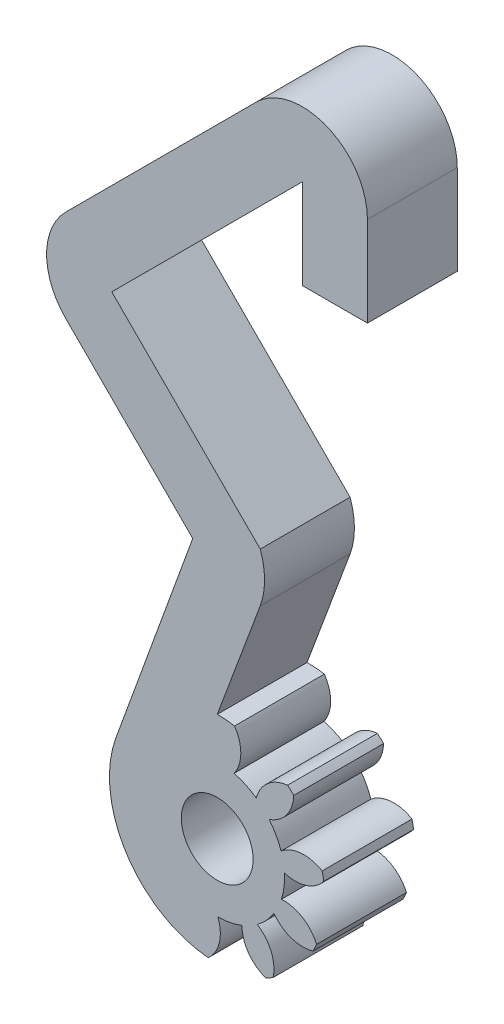
ISO-10303-21;
HEADER;
FILE_DESCRIPTION(('STEP AP214'),'2;1');
FILE_NAME('part.step','',(''),(''),'','','');
FILE_SCHEMA(('AUTOMOTIVE_DESIGN { 1 0 10303 214 1 1 1 1 }'));
ENDSEC;
DATA;
#1=APPLICATION_CONTEXT('core data for automotive mechanical design processes');
#2=APPLICATION_PROTOCOL_DEFINITION('international standard','automotive_design',2000,#1);
#3=PRODUCT_CONTEXT('',#1,'mechanical');
#4=PRODUCT('Part','Part','',(#3));
#5=PRODUCT_RELATED_PRODUCT_CATEGORY('part','',(#4));
#6=PRODUCT_DEFINITION_FORMATION('','',#4);
#7=PRODUCT_DEFINITION_CONTEXT('part definition',#1,'design');
#8=PRODUCT_DEFINITION('design','',#6,#7);
#9=PRODUCT_DEFINITION_SHAPE('','',#8);
#10=(LENGTH_UNIT() NAMED_UNIT(*) SI_UNIT(.MILLI.,.METRE.));
#11=(NAMED_UNIT(*) PLANE_ANGLE_UNIT() SI_UNIT($,.RADIAN.));
#12=(NAMED_UNIT(*) SI_UNIT($,.STERADIAN.) SOLID_ANGLE_UNIT());
#13=UNCERTAINTY_MEASURE_WITH_UNIT(LENGTH_MEASURE(1.E-05),#10,'distance_accuracy_value','');
#14=(GEOMETRIC_REPRESENTATION_CONTEXT(3) GLOBAL_UNCERTAINTY_ASSIGNED_CONTEXT((#13)) GLOBAL_UNIT_ASSIGNED_CONTEXT((#10,
#11,#12)) REPRESENTATION_CONTEXT('',''));
#15=CARTESIAN_POINT('',(0.,0.,0.));
#16=DIRECTION('',(0.,0.,1.));
#17=DIRECTION('',(1.,0.,0.));
#18=AXIS2_PLACEMENT_3D('',#15,#16,#17);
#19=CARTESIAN_POINT('',(-2.52011471353378,6.26983190867547,5.));
#20=DIRECTION('',(0.,0.,-1.));
#21=DIRECTION('',(-1.,0.,0.));
#22=AXIS2_PLACEMENT_3D('',#19,#20,#21);
#23=CYLINDRICAL_SURFACE('',#22,3.749);
#24=DIRECTION('',(0.,0.,-1.));
#25=VECTOR('',#24,1.);
#26=CARTESIAN_POINT('',(1.03442302820571,7.46157955081689,5.));
#27=LINE('',#26,#25);
#28=CARTESIAN_POINT('',(1.0344230282057,7.46157955081689,5.));
#29=VERTEX_POINT('',#28);
#30=CARTESIAN_POINT('',(1.03442302820571,7.46157955081689,0.));
#31=VERTEX_POINT('',#30);
#32=EDGE_CURVE('E263',#29,#31,#27,.T.);
#33=ORIENTED_EDGE('',*,*,#32,.T.);
#34=CARTESIAN_POINT('',(-2.52011471353378,6.26983190867547,0.));
#35=DIRECTION('',(0.,0.,1.));
#36=DIRECTION('',(-1.,0.,0.));
#37=AXIS2_PLACEMENT_3D('',#34,#35,#36);
#38=CIRCLE('',#37,3.749);
#39=CARTESIAN_POINT('',(0.374162630274847,8.65272083959863,0.));
#40=VERTEX_POINT('',#39);
#41=EDGE_CURVE('E290',#31,#40,#38,.T.);
#42=ORIENTED_EDGE('',*,*,#41,.T.);
#43=DIRECTION('',(0.,0.,-1.));
#44=VECTOR('',#43,1.);
#45=CARTESIAN_POINT('',(0.374162630274851,8.65272083959864,5.));
#46=LINE('',#45,#44);
#47=CARTESIAN_POINT('',(0.374162630274847,8.65272083959863,5.));
#48=VERTEX_POINT('',#47);
#49=EDGE_CURVE('E293',#48,#40,#46,.T.);
#50=ORIENTED_EDGE('',*,*,#49,.F.);
#51=CARTESIAN_POINT('',(-2.52011471353378,6.26983190867547,5.));
#52=DIRECTION('',(0.,0.,1.));
#53=DIRECTION('',(-1.,0.,0.));
#54=AXIS2_PLACEMENT_3D('',#51,#52,#53);
#55=CIRCLE('',#54,3.749);
#56=EDGE_CURVE('E298',#29,#48,#55,.T.);
#57=ORIENTED_EDGE('',*,*,#56,.F.);
#58=EDGE_LOOP('',(#33,#42,#50,#57));
#59=FACE_BOUND('',#58,.T.);
#60=ADVANCED_FACE('F39',(#59),#23,.T.);
#61=DIRECTION('',(0.,0.,-1.));
#62=VECTOR('',#61,1.);
#63=CARTESIAN_POINT('',(-0.344924961824448,9.32328086748562,5.));
#64=LINE('',#63,#62);
#65=CARTESIAN_POINT('',(-0.34492496182445,9.32328086748561,5.));
#66=VERTEX_POINT('',#65);
#67=CARTESIAN_POINT('',(-0.344924961824448,9.32328086748562,0.));
#68=VERTEX_POINT('',#67);
#69=EDGE_CURVE('E483',#66,#68,#64,.T.);
#70=ORIENTED_EDGE('',*,*,#69,.T.);
#71=CARTESIAN_POINT('',(-1.57922212740583,9.8988430882352,0.));
#72=VERTEX_POINT('',#71);
#73=EDGE_CURVE('E286',#68,#72,#38,.T.);
#74=ORIENTED_EDGE('',*,*,#73,.T.);
#75=DIRECTION('',(0.,0.,-1.));
#76=VECTOR('',#75,1.);
#77=CARTESIAN_POINT('',(-1.57922212740583,9.89884308823521,5.));
#78=LINE('',#77,#76);
#79=CARTESIAN_POINT('',(-1.57922212740583,9.8988430882352,5.));
#80=VERTEX_POINT('',#79);
#81=EDGE_CURVE('E55',#80,#72,#78,.T.);
#82=ORIENTED_EDGE('',*,*,#81,.F.);
#83=EDGE_CURVE('E59',#66,#80,#55,.T.);
#84=ORIENTED_EDGE('',*,*,#83,.F.);
#85=EDGE_LOOP('',(#70,#74,#82,#84));
#86=FACE_BOUND('',#85,.T.);
#87=ADVANCED_FACE('F721',(#86),#23,.T.);
#88=DIRECTION('',(0.,0.,-1.));
#89=VECTOR('',#88,1.);
#90=CARTESIAN_POINT('',(-2.48510792204046,2.52099535254911,5.));
#91=LINE('',#90,#89);
#92=CARTESIAN_POINT('',(-2.48510792204046,2.52099535254911,5.));
#93=VERTEX_POINT('',#92);
#94=CARTESIAN_POINT('',(-2.48510792204046,2.52099535254911,0.));
#95=VERTEX_POINT('',#94);
#96=EDGE_CURVE('E479',#93,#95,#91,.T.);
#97=ORIENTED_EDGE('',*,*,#96,.T.);
#98=CARTESIAN_POINT('',(-1.14823355384298,2.78085740551763,0.));
#99=VERTEX_POINT('',#98);
#100=EDGE_CURVE('E292',#95,#99,#38,.T.);
#101=ORIENTED_EDGE('',*,*,#100,.T.);
#102=DIRECTION('',(0.,0.,-1.));
#103=VECTOR('',#102,1.);
#104=CARTESIAN_POINT('',(-1.14823355384298,2.78085740551763,5.));
#105=LINE('',#104,#103);
#106=CARTESIAN_POINT('',(-1.14823355384298,2.78085740551764,5.));
#107=VERTEX_POINT('',#106);
#108=EDGE_CURVE('E485',#107,#99,#105,.T.);
#109=ORIENTED_EDGE('',*,*,#108,.F.);
#110=EDGE_CURVE('E299',#93,#107,#55,.T.);
#111=ORIENTED_EDGE('',*,*,#110,.F.);
#112=EDGE_LOOP('',(#97,#101,#109,#111));
#113=FACE_BOUND('',#112,.T.);
#114=ADVANCED_FACE('F674',(#113),#23,.T.);
#115=DIRECTION('',(0.,0.,-1.));
#116=VECTOR('',#115,1.);
#117=CARTESIAN_POINT('',(-0.288282783351155,3.25753590140504,5.));
#118=LINE('',#117,#116);
#119=CARTESIAN_POINT('',(-0.288282783351156,3.25753590140504,5.));
#120=VERTEX_POINT('',#119);
#121=CARTESIAN_POINT('',(-0.288282783351155,3.25753590140504,0.));
#122=VERTEX_POINT('',#121);
#123=EDGE_CURVE('E570',#120,#122,#118,.T.);
#124=ORIENTED_EDGE('',*,*,#123,.T.);
#125=CARTESIAN_POINT('',(0.640528217499533,4.25356375624405,0.));
#126=VERTEX_POINT('',#125);
#127=EDGE_CURVE('E669',#122,#126,#38,.T.);
#128=ORIENTED_EDGE('',*,*,#127,.T.);
#129=DIRECTION('',(0.,0.,-1.));
#130=VECTOR('',#129,1.);
#131=CARTESIAN_POINT('',(0.640528217499532,4.25356375624405,5.));
#132=LINE('',#131,#130);
#133=CARTESIAN_POINT('',(0.640528217499533,4.25356375624405,5.));
#134=VERTEX_POINT('',#133);
#135=EDGE_CURVE('E566',#134,#126,#132,.T.);
#136=ORIENTED_EDGE('',*,*,#135,.F.);
#137=EDGE_CURVE('E654',#120,#134,#55,.T.);
#138=ORIENTED_EDGE('',*,*,#137,.F.);
#139=EDGE_LOOP('',(#124,#128,#136,#138));
#140=FACE_BOUND('',#139,.T.);
#141=ADVANCED_FACE('F730',(#140),#23,.T.);
#142=DIRECTION('',(0.,0.,-1.));
#143=VECTOR('',#142,1.);
#144=CARTESIAN_POINT('',(1.05605841518567,5.14467114086269,5.));
#145=LINE('',#144,#143);
#146=CARTESIAN_POINT('',(1.05605841518566,5.14467114086269,5.));
#147=VERTEX_POINT('',#146);
#148=CARTESIAN_POINT('',(1.05605841518567,5.14467114086269,0.));
#149=VERTEX_POINT('',#148);
#150=EDGE_CURVE('E554',#147,#149,#145,.T.);
#151=ORIENTED_EDGE('',*,*,#150,.T.);
#152=CARTESIAN_POINT('',(1.2220318154894,6.49641601076531,0.));
#153=VERTEX_POINT('',#152);
#154=EDGE_CURVE('E662',#149,#153,#38,.T.);
#155=ORIENTED_EDGE('',*,*,#154,.T.);
#156=DIRECTION('',(0.,0.,-1.));
#157=VECTOR('',#156,1.);
#158=CARTESIAN_POINT('',(1.2220318154894,6.49641601076531,5.));
#159=LINE('',#158,#157);
#160=CARTESIAN_POINT('',(1.2220318154894,6.49641601076531,5.));
#161=VERTEX_POINT('',#160);
#162=EDGE_CURVE('E550',#161,#153,#159,.T.);
#163=ORIENTED_EDGE('',*,*,#162,.F.);
#164=EDGE_CURVE('E656',#147,#161,#55,.T.);
#165=ORIENTED_EDGE('',*,*,#164,.F.);
#166=EDGE_LOOP('',(#151,#155,#163,#165));
#167=FACE_BOUND('',#166,.T.);
#168=ADVANCED_FACE('F666',(#167),#23,.T.);
#169=CARTESIAN_POINT('',(-2.52011471353377,6.26983190867546,5.));
#170=DIRECTION('',(0.,0.,-1.));
#171=DIRECTION('',(-1.,0.,0.));
#172=AXIS2_PLACEMENT_3D('',#169,#170,#171);
#173=CYLINDRICAL_SURFACE('',#172,6.);
#174=CARTESIAN_POINT('',(-2.52011471353377,6.26983190867546,5.));
#175=DIRECTION('',(0.,0.,1.));
#176=DIRECTION('',(1.,0.,0.));
#177=AXIS2_PLACEMENT_3D('',#174,#175,#176);
#178=CIRCLE('',#177,6.);
#179=CARTESIAN_POINT('',(-1.55644099664738,12.1919373592211,5.));
#180=VERTEX_POINT('',#179);
#181=CARTESIAN_POINT('',(-2.52011471353377,12.2698319086755,5.));
#182=VERTEX_POINT('',#181);
#183=EDGE_CURVE('E347',#180,#182,#178,.T.);
#184=ORIENTED_EDGE('',*,*,#183,.F.);
#185=DIRECTION('',(0.,0.,-1.));
#186=VECTOR('',#185,1.);
#187=CARTESIAN_POINT('',(-1.55644099664738,12.1919373592211,5.));
#188=LINE('',#187,#186);
#189=CARTESIAN_POINT('',(-1.55644099664738,12.1919373592211,0.));
#190=VERTEX_POINT('',#189);
#191=EDGE_CURVE('E472',#180,#190,#188,.T.);
#192=ORIENTED_EDGE('',*,*,#191,.T.);
#193=CARTESIAN_POINT('',(-2.52011471353377,6.26983190867546,0.));
#194=DIRECTION('',(0.,0.,1.));
#195=DIRECTION('',(1.,0.,0.));
#196=AXIS2_PLACEMENT_3D('',#193,#194,#195);
#197=CIRCLE('',#196,6.);
#198=CARTESIAN_POINT('',(-2.52011471353377,12.2698319086755,0.));
#199=VERTEX_POINT('',#198);
#200=EDGE_CURVE('E394',#190,#199,#197,.T.);
#201=ORIENTED_EDGE('',*,*,#200,.T.);
#202=DIRECTION('',(0.,0.,-1.));
#203=VECTOR('',#202,1.);
#204=CARTESIAN_POINT('',(-2.52011471353377,12.2698319086755,5.));
#205=LINE('',#204,#203);
#206=EDGE_CURVE('E351',#182,#199,#205,.T.);
#207=ORIENTED_EDGE('',*,*,#206,.F.);
#208=EDGE_LOOP('',(#184,#192,#201,#207));
#209=FACE_BOUND('',#208,.T.);
#210=ADVANCED_FACE('F477',(#209),#173,.T.);
#211=CARTESIAN_POINT('',(-2.52011471353377,12.2698319086755,5.));
#212=DIRECTION('',(-0.937067689095554,0.349147742443107,0.));
#213=DIRECTION('',(-0.349147742443107,-0.937067689095554,0.));
#214=AXIS2_PLACEMENT_3D('',#211,#212,#213);
#215=PLANE('',#214);
#216=DIRECTION('',(0.349147742443107,0.937067689095554,0.));
#217=VECTOR('',#216,1.);
#218=CARTESIAN_POINT('',(-2.52011471353377,12.2698319086755,0.));
#219=LINE('',#218,#217);
#220=CARTESIAN_POINT('',(-0.124248163534779,18.7000299551507,0.));
#221=VERTEX_POINT('',#220);
#222=EDGE_CURVE('E305',#199,#221,#219,.T.);
#223=ORIENTED_EDGE('',*,*,#222,.T.);
#224=DIRECTION('',(0.,0.,-1.));
#225=VECTOR('',#224,1.);
#226=CARTESIAN_POINT('',(-0.124248163534779,18.7000299551507,5.));
#227=LINE('',#226,#225);
#228=CARTESIAN_POINT('',(-0.124248163534779,18.7000299551507,5.));
#229=VERTEX_POINT('',#228);
#230=EDGE_CURVE('E11',#229,#221,#227,.T.);
#231=ORIENTED_EDGE('',*,*,#230,.F.);
#232=DIRECTION('',(0.349147742443107,0.937067689095554,0.));
#233=VECTOR('',#232,1.);
#234=CARTESIAN_POINT('',(-2.52011471353377,12.2698319086755,5.));
#235=LINE('',#234,#233);
#236=EDGE_CURVE('E306',#182,#229,#235,.T.);
#237=ORIENTED_EDGE('',*,*,#236,.F.);
#238=ORIENTED_EDGE('',*,*,#206,.T.);
#239=EDGE_LOOP('',(#223,#231,#237,#238));
#240=FACE_BOUND('',#239,.T.);
#241=ADVANCED_FACE('F41',(#240),#215,.F.);
#242=CARTESIAN_POINT('',(-3.88301864667842,20.0681105284533,5.));
#243=DIRECTION('',(0.,0.,-1.));
#244=DIRECTION('',(-1.,0.,0.));
#245=AXIS2_PLACEMENT_3D('',#242,#243,#244);
#246=CYLINDRICAL_SURFACE('',#245,4.);
#247=CARTESIAN_POINT('',(-3.88301864667842,20.0681105284533,0.));
#248=DIRECTION('',(0.,0.,1.));
#249=DIRECTION('',(1.,0.,0.));
#250=AXIS2_PLACEMENT_3D('',#247,#248,#249);
#251=CIRCLE('',#250,4.);
#252=CARTESIAN_POINT('',(-0.124248163534785,21.436191101756,0.));
#253=VERTEX_POINT('',#252);
#254=EDGE_CURVE('E355',#221,#253,#251,.T.);
#255=ORIENTED_EDGE('',*,*,#254,.T.);
#256=DIRECTION('',(0.,0.,-1.));
#257=VECTOR('',#256,1.);
#258=CARTESIAN_POINT('',(-0.124248163534785,21.436191101756,5.));
#259=LINE('',#258,#257);
#260=CARTESIAN_POINT('',(-0.124248163534785,21.436191101756,5.));
#261=VERTEX_POINT('',#260);
#262=EDGE_CURVE('E48',#261,#253,#259,.T.);
#263=ORIENTED_EDGE('',*,*,#262,.F.);
#264=CARTESIAN_POINT('',(-3.88301864667842,20.0681105284533,5.));
#265=DIRECTION('',(0.,0.,1.));
#266=DIRECTION('',(1.,0.,0.));
#267=AXIS2_PLACEMENT_3D('',#264,#265,#266);
#268=CIRCLE('',#267,4.);
#269=EDGE_CURVE('E310',#229,#261,#268,.T.);
#270=ORIENTED_EDGE('',*,*,#269,.F.);
#271=ORIENTED_EDGE('',*,*,#230,.T.);
#272=EDGE_LOOP('',(#255,#263,#270,#271));
#273=FACE_BOUND('',#272,.T.);
#274=ADVANCED_FACE('F441',(#273),#246,.T.);
#275=CARTESIAN_POINT('',(-8.3906609303208,29.7026038685419,5.));
#276=DIRECTION('',(0.707106781186544,0.707106781186552,0.));
#277=DIRECTION('',(-0.707106781186552,0.707106781186544,0.));
#278=AXIS2_PLACEMENT_3D('',#275,#276,#277);
#279=PLANE('',#278);
#280=DIRECTION('',(0.707106781186552,-0.707106781186544,0.));
#281=VECTOR('',#280,1.);
#282=CARTESIAN_POINT('',(-8.3906609303208,29.7026038685419,0.));
#283=LINE('',#282,#281);
#284=CARTESIAN_POINT('',(-8.3906609303208,29.7026038685419,0.));
#285=VERTEX_POINT('',#284);
#286=EDGE_CURVE('E359',#285,#253,#283,.T.);
#287=ORIENTED_EDGE('',*,*,#286,.F.);
#288=DIRECTION('',(0.,0.,-1.));
#289=VECTOR('',#288,1.);
#290=CARTESIAN_POINT('',(-8.3906609303208,29.7026038685419,5.));
#291=LINE('',#290,#289);
#292=CARTESIAN_POINT('',(-8.3906609303208,29.7026038685419,5.));
#293=VERTEX_POINT('',#292);
#294=EDGE_CURVE('E432',#293,#285,#291,.T.);
#295=ORIENTED_EDGE('',*,*,#294,.F.);
#296=DIRECTION('',(0.707106781186552,-0.707106781186544,0.));
#297=VECTOR('',#296,1.);
#298=CARTESIAN_POINT('',(-8.3906609303208,29.7026038685419,5.));
#299=LINE('',#298,#297);
#300=EDGE_CURVE('E314',#293,#261,#299,.T.);
#301=ORIENTED_EDGE('',*,*,#300,.T.);
#302=ORIENTED_EDGE('',*,*,#262,.T.);
#303=EDGE_LOOP('',(#287,#295,#301,#302));
#304=FACE_BOUND('',#303,.T.);
#305=ADVANCED_FACE('F438',(#304),#279,.T.);
#306=CARTESIAN_POINT('',(-8.3906609303208,29.7026038685419,5.));
#307=DIRECTION('',(-0.707106781186548,0.707106781186548,0.));
#308=DIRECTION('',(-0.707106781186548,-0.707106781186548,0.));
#309=AXIS2_PLACEMENT_3D('',#306,#307,#308);
#310=PLANE('',#309);
#311=DIRECTION('',(0.707106781186548,0.707106781186548,0.));
#312=VECTOR('',#311,1.);
#313=CARTESIAN_POINT('',(-8.3906609303208,29.7026038685419,0.));
#314=LINE('',#313,#312);
#315=CARTESIAN_POINT('',(2.21594078747746,40.3092055863402,0.));
#316=VERTEX_POINT('',#315);
#317=EDGE_CURVE('E363',#285,#316,#314,.T.);
#318=ORIENTED_EDGE('',*,*,#317,.T.);
#319=DIRECTION('',(0.,0.,-1.));
#320=VECTOR('',#319,1.);
#321=CARTESIAN_POINT('',(2.21594078747746,40.3092055863402,5.));
#322=LINE('',#321,#320);
#323=CARTESIAN_POINT('',(2.21594078747746,40.3092055863402,5.));
#324=VERTEX_POINT('',#323);
#325=EDGE_CURVE('E428',#324,#316,#322,.T.);
#326=ORIENTED_EDGE('',*,*,#325,.F.);
#327=DIRECTION('',(0.707106781186548,0.707106781186548,0.));
#328=VECTOR('',#327,1.);
#329=CARTESIAN_POINT('',(-8.3906609303208,29.7026038685419,5.));
#330=LINE('',#329,#328);
#331=EDGE_CURVE('E318',#293,#324,#330,.T.);
#332=ORIENTED_EDGE('',*,*,#331,.F.);
#333=ORIENTED_EDGE('',*,*,#294,.T.);
#334=EDGE_LOOP('',(#318,#326,#332,#333));
#335=FACE_BOUND('',#334,.T.);
#336=ADVANCED_FACE('F451',(#335),#310,.F.);
#337=CARTESIAN_POINT('',(2.21594078747746,40.3092055863402,5.));
#338=DIRECTION('',(1.,0.,0.));
#339=DIRECTION('',(0.,1.,0.));
#340=AXIS2_PLACEMENT_3D('',#337,#338,#339);
#341=PLANE('',#340);
#342=DIRECTION('',(0.,-1.,0.));
#343=VECTOR('',#342,1.);
#344=CARTESIAN_POINT('',(2.21594078747746,40.3092055863402,0.));
#345=LINE('',#344,#343);
#346=CARTESIAN_POINT('',(2.21594078747746,35.3092055863402,0.));
#347=VERTEX_POINT('',#346);
#348=EDGE_CURVE('E366',#316,#347,#345,.T.);
#349=ORIENTED_EDGE('',*,*,#348,.T.);
#350=DIRECTION('',(0.,0.,-1.));
#351=VECTOR('',#350,1.);
#352=CARTESIAN_POINT('',(2.21594078747746,35.3092055863402,5.));
#353=LINE('',#352,#351);
#354=CARTESIAN_POINT('',(2.21594078747746,35.3092055863402,5.));
#355=VERTEX_POINT('',#354);
#356=EDGE_CURVE('E424',#355,#347,#353,.T.);
#357=ORIENTED_EDGE('',*,*,#356,.F.);
#358=DIRECTION('',(0.,-1.,0.));
#359=VECTOR('',#358,1.);
#360=CARTESIAN_POINT('',(2.21594078747746,40.3092055863402,5.));
#361=LINE('',#360,#359);
#362=EDGE_CURVE('E321',#324,#355,#361,.T.);
#363=ORIENTED_EDGE('',*,*,#362,.F.);
#364=ORIENTED_EDGE('',*,*,#325,.T.);
#365=EDGE_LOOP('',(#349,#357,#363,#364));
#366=FACE_BOUND('',#365,.T.);
#367=ADVANCED_FACE('F455',(#366),#341,.F.);
#368=CARTESIAN_POINT('',(2.21594078747746,35.3092055863402,5.));
#369=DIRECTION('',(0.,1.,0.));
#370=DIRECTION('',(0.,0.,1.));
#371=AXIS2_PLACEMENT_3D('',#368,#369,#370);
#372=PLANE('',#371);
#373=DIRECTION('',(1.,0.,0.));
#374=VECTOR('',#373,1.);
#375=CARTESIAN_POINT('',(2.21594078747746,35.3092055863402,0.));
#376=LINE('',#375,#374);
#377=CARTESIAN_POINT('',(5.84117193562413,35.3092055863402,0.));
#378=VERTEX_POINT('',#377);
#379=EDGE_CURVE('E369',#347,#378,#376,.T.);
#380=ORIENTED_EDGE('',*,*,#379,.T.);
#381=DIRECTION('',(0.,0.,-1.));
#382=VECTOR('',#381,1.);
#383=CARTESIAN_POINT('',(5.84117193562413,35.3092055863402,5.));
#384=LINE('',#383,#382);
#385=CARTESIAN_POINT('',(5.84117193562413,35.3092055863402,5.));
#386=VERTEX_POINT('',#385);
#387=EDGE_CURVE('E420',#386,#378,#384,.T.);
#388=ORIENTED_EDGE('',*,*,#387,.F.);
#389=DIRECTION('',(1.,0.,0.));
#390=VECTOR('',#389,1.);
#391=CARTESIAN_POINT('',(2.21594078747746,35.3092055863402,5.));
#392=LINE('',#391,#390);
#393=EDGE_CURVE('E324',#355,#386,#392,.T.);
#394=ORIENTED_EDGE('',*,*,#393,.F.);
#395=ORIENTED_EDGE('',*,*,#356,.T.);
#396=EDGE_LOOP('',(#380,#388,#394,#395));
#397=FACE_BOUND('',#396,.T.);
#398=ADVANCED_FACE('F711',(#397),#372,.F.);
#399=CARTESIAN_POINT('',(5.84117193562413,35.3092055863402,5.));
#400=DIRECTION('',(-1.,0.,0.));
#401=DIRECTION('',(0.,0.,1.));
#402=AXIS2_PLACEMENT_3D('',#399,#400,#401);
#403=PLANE('',#402);
#404=DIRECTION('',(0.,1.,0.));
#405=VECTOR('',#404,1.);
#406=CARTESIAN_POINT('',(5.84117193562413,35.3092055863402,0.));
#407=LINE('',#406,#405);
#408=CARTESIAN_POINT('',(5.84117193562414,40.3092055863402,0.));
#409=VERTEX_POINT('',#408);
#410=EDGE_CURVE('E372',#378,#409,#407,.T.);
#411=ORIENTED_EDGE('',*,*,#410,.T.);
#412=DIRECTION('',(0.,0.,-1.));
#413=VECTOR('',#412,1.);
#414=CARTESIAN_POINT('',(5.84117193562414,40.3092055863402,5.));
#415=LINE('',#414,#413);
#416=CARTESIAN_POINT('',(5.84117193562414,40.3092055863402,5.));
#417=VERTEX_POINT('',#416);
#418=EDGE_CURVE('E417',#417,#409,#415,.T.);
#419=ORIENTED_EDGE('',*,*,#418,.F.);
#420=DIRECTION('',(0.,1.,0.));
#421=VECTOR('',#420,1.);
#422=CARTESIAN_POINT('',(5.84117193562413,35.3092055863402,5.));
#423=LINE('',#422,#421);
#424=EDGE_CURVE('E327',#386,#417,#423,.T.);
#425=ORIENTED_EDGE('',*,*,#424,.F.);
#426=ORIENTED_EDGE('',*,*,#387,.T.);
#427=EDGE_LOOP('',(#411,#419,#425,#426));
#428=FACE_BOUND('',#427,.T.);
#429=ADVANCED_FACE('F708',(#428),#403,.F.);
#430=CARTESIAN_POINT('',(2.21594078747746,40.3092055863402,5.));
#431=DIRECTION('',(0.,0.,-1.));
#432=DIRECTION('',(-1.,0.,0.));
#433=AXIS2_PLACEMENT_3D('',#430,#431,#432);
#434=CYLINDRICAL_SURFACE('',#433,3.62523114814667);
#435=CARTESIAN_POINT('',(2.21594078747746,40.3092055863402,0.));
#436=DIRECTION('',(0.,0.,-1.));
#437=DIRECTION('',(-1.,0.,0.));
#438=AXIS2_PLACEMENT_3D('',#435,#436,#437);
#439=CIRCLE('',#438,3.62523114814667);
#440=CARTESIAN_POINT('',(-0.347484740745742,42.8726311145634,0.));
#441=VERTEX_POINT('',#440);
#442=EDGE_CURVE('E376',#441,#409,#439,.T.);
#443=ORIENTED_EDGE('',*,*,#442,.F.);
#444=DIRECTION('',(0.,0.,-1.));
#445=VECTOR('',#444,1.);
#446=CARTESIAN_POINT('',(-0.347484740745742,42.8726311145634,5.));
#447=LINE('',#446,#445);
#448=CARTESIAN_POINT('',(-0.347484740745742,42.8726311145634,5.));
#449=VERTEX_POINT('',#448);
#450=EDGE_CURVE('E414',#449,#441,#447,.T.);
#451=ORIENTED_EDGE('',*,*,#450,.F.);
#452=CARTESIAN_POINT('',(2.21594078747746,40.3092055863402,5.));
#453=DIRECTION('',(0.,0.,-1.));
#454=DIRECTION('',(-1.,0.,0.));
#455=AXIS2_PLACEMENT_3D('',#452,#453,#454);
#456=CIRCLE('',#455,3.62523114814667);
#457=EDGE_CURVE('E330',#449,#417,#456,.T.);
#458=ORIENTED_EDGE('',*,*,#457,.T.);
#459=ORIENTED_EDGE('',*,*,#418,.T.);
#460=EDGE_LOOP('',(#443,#451,#458,#459));
#461=FACE_BOUND('',#460,.T.);
#462=ADVANCED_FACE('F704',(#461),#434,.T.);
#463=CARTESIAN_POINT('',(-0.347484740745742,42.8726311145634,5.));
#464=DIRECTION('',(0.707106781186551,-0.707106781186544,0.));
#465=DIRECTION('',(0.707106781186544,0.707106781186551,0.));
#466=AXIS2_PLACEMENT_3D('',#463,#464,#465);
#467=PLANE('',#466);
#468=DIRECTION('',(-0.707106781186544,-0.707106781186551,0.));
#469=VECTOR('',#468,1.);
#470=CARTESIAN_POINT('',(-0.347484740745742,42.8726311145634,0.));
#471=LINE('',#470,#469);
#472=CARTESIAN_POINT('',(-10.954086458544,32.2660293967651,0.));
#473=VERTEX_POINT('',#472);
#474=EDGE_CURVE('E380',#441,#473,#471,.T.);
#475=ORIENTED_EDGE('',*,*,#474,.T.);
#476=DIRECTION('',(0.,0.,-1.));
#477=VECTOR('',#476,1.);
#478=CARTESIAN_POINT('',(-10.954086458544,32.2660293967651,5.));
#479=LINE('',#478,#477);
#480=CARTESIAN_POINT('',(-10.954086458544,32.2660293967651,5.));
#481=VERTEX_POINT('',#480);
#482=EDGE_CURVE('E410',#481,#473,#479,.T.);
#483=ORIENTED_EDGE('',*,*,#482,.F.);
#484=DIRECTION('',(-0.707106781186544,-0.707106781186551,0.));
#485=VECTOR('',#484,1.);
#486=CARTESIAN_POINT('',(-0.347484740745742,42.8726311145634,5.));
#487=LINE('',#486,#485);
#488=EDGE_CURVE('E334',#449,#481,#487,.T.);
#489=ORIENTED_EDGE('',*,*,#488,.F.);
#490=ORIENTED_EDGE('',*,*,#450,.T.);
#491=EDGE_LOOP('',(#475,#483,#489,#490));
#492=FACE_BOUND('',#491,.T.);
#493=ADVANCED_FACE('F701',(#492),#467,.F.);
#494=CARTESIAN_POINT('',(-8.3906609303208,29.7026038685419,5.));
#495=DIRECTION('',(0.,0.,-1.));
#496=DIRECTION('',(-1.,0.,0.));
#497=AXIS2_PLACEMENT_3D('',#494,#495,#496);
#498=CYLINDRICAL_SURFACE('',#497,3.62523114814659);
#499=CARTESIAN_POINT('',(-8.3906609303208,29.7026038685419,0.));
#500=DIRECTION('',(0.,0.,1.));
#501=DIRECTION('',(1.,0.,0.));
#502=AXIS2_PLACEMENT_3D('',#499,#500,#501);
#503=CIRCLE('',#502,3.62523114814659);
#504=CARTESIAN_POINT('',(-10.9540864585439,27.1391783403188,0.));
#505=VERTEX_POINT('',#504);
#506=EDGE_CURVE('E383',#473,#505,#503,.T.);
#507=ORIENTED_EDGE('',*,*,#506,.T.);
#508=DIRECTION('',(0.,0.,-1.));
#509=VECTOR('',#508,1.);
#510=CARTESIAN_POINT('',(-10.9540864585439,27.1391783403188,5.));
#511=LINE('',#510,#509);
#512=CARTESIAN_POINT('',(-10.9540864585439,27.1391783403188,5.));
#513=VERTEX_POINT('',#512);
#514=EDGE_CURVE('E407',#513,#505,#511,.T.);
#515=ORIENTED_EDGE('',*,*,#514,.F.);
#516=CARTESIAN_POINT('',(-8.3906609303208,29.7026038685419,5.));
#517=DIRECTION('',(0.,0.,1.));
#518=DIRECTION('',(1.,0.,0.));
#519=AXIS2_PLACEMENT_3D('',#516,#517,#518);
#520=CIRCLE('',#519,3.62523114814659);
#521=EDGE_CURVE('E337',#481,#513,#520,.T.);
#522=ORIENTED_EDGE('',*,*,#521,.F.);
#523=ORIENTED_EDGE('',*,*,#482,.T.);
#524=EDGE_LOOP('',(#507,#515,#522,#523));
#525=FACE_BOUND('',#524,.T.);
#526=ADVANCED_FACE('F696',(#525),#498,.T.);
#527=CARTESIAN_POINT('',(-3.88301864667842,20.0681105284533,5.));
#528=DIRECTION('',(-0.707106781186543,-0.707106781186552,0.));
#529=DIRECTION('',(0.707106781186552,-0.707106781186543,0.));
#530=AXIS2_PLACEMENT_3D('',#527,#528,#529);
#531=PLANE('',#530);
#532=DIRECTION('',(-0.707106781186552,0.707106781186543,0.));
#533=VECTOR('',#532,1.);
#534=CARTESIAN_POINT('',(-3.88301864667842,20.0681105284533,0.));
#535=LINE('',#534,#533);
#536=CARTESIAN_POINT('',(-3.88301864667842,20.0681105284533,0.));
#537=VERTEX_POINT('',#536);
#538=EDGE_CURVE('E387',#537,#505,#535,.T.);
#539=ORIENTED_EDGE('',*,*,#538,.F.);
#540=DIRECTION('',(0.,0.,-1.));
#541=VECTOR('',#540,1.);
#542=CARTESIAN_POINT('',(-3.88301864667842,20.0681105284533,5.));
#543=LINE('',#542,#541);
#544=CARTESIAN_POINT('',(-3.88301864667842,20.0681105284533,5.));
#545=VERTEX_POINT('',#544);
#546=EDGE_CURVE('E404',#545,#537,#543,.T.);
#547=ORIENTED_EDGE('',*,*,#546,.F.);
#548=DIRECTION('',(-0.707106781186552,0.707106781186543,0.));
#549=VECTOR('',#548,1.);
#550=CARTESIAN_POINT('',(-3.88301864667842,20.0681105284533,5.));
#551=LINE('',#550,#549);
#552=EDGE_CURVE('E340',#545,#513,#551,.T.);
#553=ORIENTED_EDGE('',*,*,#552,.T.);
#554=ORIENTED_EDGE('',*,*,#514,.T.);
#555=EDGE_LOOP('',(#539,#547,#553,#554));
#556=FACE_BOUND('',#555,.T.);
#557=ADVANCED_FACE('F690',(#556),#531,.T.);
#558=CARTESIAN_POINT('',(-3.88301864667842,20.0681105284533,5.));
#559=DIRECTION('',(0.93969262078591,-0.342020143325665,0.));
#560=DIRECTION('',(0.342020143325665,0.93969262078591,0.));
#561=AXIS2_PLACEMENT_3D('',#558,#559,#560);
#562=PLANE('',#561);
#563=DIRECTION('',(-0.342020143325665,-0.93969262078591,0.));
#564=VECTOR('',#563,1.);
#565=CARTESIAN_POINT('',(-3.88301864667842,20.0681105284533,0.));
#566=LINE('',#565,#564);
#567=CARTESIAN_POINT('',(-8.15827043824923,8.32195276862945,0.));
#568=VERTEX_POINT('',#567);
#569=EDGE_CURVE('E391',#537,#568,#566,.T.);
#570=ORIENTED_EDGE('',*,*,#569,.T.);
#571=DIRECTION('',(0.,0.,-1.));
#572=VECTOR('',#571,1.);
#573=CARTESIAN_POINT('',(-8.15827043824923,8.32195276862945,5.));
#574=LINE('',#573,#572);
#575=CARTESIAN_POINT('',(-8.15827043824923,8.32195276862945,5.));
#576=VERTEX_POINT('',#575);
#577=EDGE_CURVE('E400',#576,#568,#574,.T.);
#578=ORIENTED_EDGE('',*,*,#577,.F.);
#579=DIRECTION('',(-0.342020143325665,-0.93969262078591,0.));
#580=VECTOR('',#579,1.);
#581=CARTESIAN_POINT('',(-3.88301864667842,20.0681105284533,5.));
#582=LINE('',#581,#580);
#583=EDGE_CURVE('E344',#545,#576,#582,.T.);
#584=ORIENTED_EDGE('',*,*,#583,.F.);
#585=ORIENTED_EDGE('',*,*,#546,.T.);
#586=EDGE_LOOP('',(#570,#578,#584,#585));
#587=FACE_BOUND('',#586,.T.);
#588=ADVANCED_FACE('F687',(#587),#562,.F.);
#589=DIRECTION('',(0.,0.,-1.));
#590=VECTOR('',#589,1.);
#591=CARTESIAN_POINT('',(-3.0177532010514,0.2905045271265,5.));
#592=LINE('',#591,#590);
#593=CARTESIAN_POINT('',(-3.0177532010514,0.2905045271265,5.));
#594=VERTEX_POINT('',#593);
#595=CARTESIAN_POINT('',(-3.0177532010514,0.290504527126497,0.));
#596=VERTEX_POINT('',#595);
#597=EDGE_CURVE('E301',#594,#596,#592,.T.);
#598=ORIENTED_EDGE('',*,*,#597,.F.);
#599=EDGE_CURVE('E348',#576,#594,#178,.T.);
#600=ORIENTED_EDGE('',*,*,#599,.F.);
#601=ORIENTED_EDGE('',*,*,#577,.T.);
#602=EDGE_CURVE('E311',#568,#596,#197,.T.);
#603=ORIENTED_EDGE('',*,*,#602,.T.);
#604=EDGE_LOOP('',(#598,#600,#601,#603));
#605=FACE_BOUND('',#604,.T.);
#606=ADVANCED_FACE('F682',(#605),#173,.T.);
#607=CARTESIAN_POINT('',(-3.88301864667842,20.0681105284533,5.));
#608=DIRECTION('',(0.,0.,1.));
#609=DIRECTION('',(1.,0.,0.));
#610=AXIS2_PLACEMENT_3D('',#607,#608,#609);
#611=PLANE('',#610);
#612=CARTESIAN_POINT('',(-2.52011471353377,6.26983190867546,5.));
#613=DIRECTION('',(0.,0.,-1.));
#614=DIRECTION('',(-1.,0.,0.));
#615=AXIS2_PLACEMENT_3D('',#612,#613,#614);
#616=CIRCLE('',#615,2.);
#617=CARTESIAN_POINT('',(-4.52011471353377,6.26983190867546,5.));
#618=VERTEX_POINT('',#617);
#619=EDGE_CURVE('E625',#618,#618,#616,.T.);
#620=ORIENTED_EDGE('',*,*,#619,.T.);
#621=EDGE_LOOP('',(#620));
#622=FACE_BOUND('',#621,.T.);
#623=CARTESIAN_POINT('',(-3.20643917659579,11.0616692467067,5.));
#624=DIRECTION('',(0.,0.,1.));
#625=DIRECTION('',(1.,0.,0.));
#626=AXIS2_PLACEMENT_3D('',#623,#624,#625);
#627=CIRCLE('',#626,2.);
#628=EDGE_CURVE('E644',#80,#180,#627,.T.);
#629=ORIENTED_EDGE('',*,*,#628,.T.);
#630=ORIENTED_EDGE('',*,*,#183,.T.);
#631=ORIENTED_EDGE('',*,*,#236,.T.);
#632=ORIENTED_EDGE('',*,*,#269,.T.);
#633=ORIENTED_EDGE('',*,*,#300,.F.);
#634=ORIENTED_EDGE('',*,*,#331,.T.);
#635=ORIENTED_EDGE('',*,*,#362,.T.);
#636=ORIENTED_EDGE('',*,*,#393,.T.);
#637=ORIENTED_EDGE('',*,*,#424,.T.);
#638=ORIENTED_EDGE('',*,*,#457,.F.);
#639=ORIENTED_EDGE('',*,*,#488,.T.);
#640=ORIENTED_EDGE('',*,*,#521,.T.);
#641=ORIENTED_EDGE('',*,*,#552,.F.);
#642=ORIENTED_EDGE('',*,*,#583,.T.);
#643=ORIENTED_EDGE('',*,*,#599,.T.);
#644=CARTESIAN_POINT('',(-4.3453027791032,1.78636953367439,5.));
#645=DIRECTION('',(0.,0.,1.));
#646=DIRECTION('',(1.,0.,0.));
#647=AXIS2_PLACEMENT_3D('',#644,#645,#646);
#648=CIRCLE('',#647,2.);
#649=EDGE_CURVE('E647',#594,#93,#648,.T.);
#650=ORIENTED_EDGE('',*,*,#649,.T.);
#651=ORIENTED_EDGE('',*,*,#110,.T.);
#652=CARTESIAN_POINT('',(0.851704759417803,2.79656546560319,5.));
#653=DIRECTION('',(0.,0.,1.));
#654=DIRECTION('',(1.,0.,0.));
#655=AXIS2_PLACEMENT_3D('',#652,#653,#654);
#656=CIRCLE('',#655,2.00000000000001);
#657=CARTESIAN_POINT('',(0.181183118824227,0.91231475789582,5.));
#658=VERTEX_POINT('',#657);
#659=EDGE_CURVE('E588',#107,#658,#656,.T.);
#660=ORIENTED_EDGE('',*,*,#659,.T.);
#661=CARTESIAN_POINT('',(-2.52011471353378,6.26983190867547,5.));
#662=DIRECTION('',(0.,0.,1.));
#663=DIRECTION('',(1.,0.,0.));
#664=AXIS2_PLACEMENT_3D('',#661,#662,#663);
#665=CIRCLE('',#664,6.00000000000001);
#666=CARTESIAN_POINT('',(0.591847746512484,1.13994987813491,5.));
#667=VERTEX_POINT('',#666);
#668=EDGE_CURVE('E608',#658,#667,#665,.T.);
#669=ORIENTED_EDGE('',*,*,#668,.T.);
#670=CARTESIAN_POINT('',(-1.36140981327594,1.569816026057,5.));
#671=DIRECTION('',(0.,0.,1.));
#672=DIRECTION('',(1.,0.,0.));
#673=AXIS2_PLACEMENT_3D('',#670,#671,#672);
#674=CIRCLE('',#673,2.00000000000001);
#675=EDGE_CURVE('E604',#667,#120,#674,.T.);
#676=ORIENTED_EDGE('',*,*,#675,.T.);
#677=ORIENTED_EDGE('',*,*,#137,.T.);
#678=CARTESIAN_POINT('',(2.24927933456865,5.4418060898313,5.));
#679=DIRECTION('',(0.,0.,1.));
#680=DIRECTION('',(1.,0.,0.));
#681=AXIS2_PLACEMENT_3D('',#678,#679,#680);
#682=CIRCLE('',#681,2.00000000000001);
#683=CARTESIAN_POINT('',(2.81435070984433,3.52329251394916,5.));
#684=VERTEX_POINT('',#683);
#685=EDGE_CURVE('E607',#134,#684,#682,.T.);
#686=ORIENTED_EDGE('',*,*,#685,.T.);
#687=CARTESIAN_POINT('',(-2.52011471353378,6.26983190867547,5.));
#688=DIRECTION('',(0.,0.,1.));
#689=DIRECTION('',(1.,0.,0.));
#690=AXIS2_PLACEMENT_3D('',#687,#688,#689);
#691=CIRCLE('',#690,6.00000000000001);
#692=CARTESIAN_POINT('',(3.01278480605243,3.94883580653249,5.));
#693=VERTEX_POINT('',#692);
#694=EDGE_CURVE('E612',#684,#693,#691,.T.);
#695=ORIENTED_EDGE('',*,*,#694,.T.);
#696=CARTESIAN_POINT('',(1.17989726358387,3.14850883793554,5.));
#697=DIRECTION('',(0.,0.,1.));
#698=DIRECTION('',(1.,0.,0.));
#699=AXIS2_PLACEMENT_3D('',#696,#697,#698);
#700=CIRCLE('',#699,2.);
#701=EDGE_CURVE('E619',#693,#147,#700,.T.);
#702=ORIENTED_EDGE('',*,*,#701,.T.);
#703=ORIENTED_EDGE('',*,*,#164,.T.);
#704=CARTESIAN_POINT('',(1.82510748908582,8.40332443329541,5.));
#705=DIRECTION('',(0.,0.,1.));
#706=DIRECTION('',(1.,0.,0.));
#707=AXIS2_PLACEMENT_3D('',#704,#705,#706);
#708=CIRCLE('',#707,2.);
#709=CARTESIAN_POINT('',(3.40993382094508,7.18335496734738,5.));
#710=VERTEX_POINT('',#709);
#711=EDGE_CURVE('E275',#161,#710,#708,.T.);
#712=ORIENTED_EDGE('',*,*,#711,.T.);
#713=CARTESIAN_POINT('',(-2.52011471353378,6.26983190867547,5.));
#714=DIRECTION('',(0.,0.,1.));
#715=DIRECTION('',(1.,0.,0.));
#716=AXIS2_PLACEMENT_3D('',#713,#714,#715);
#717=CIRCLE('',#716,6.00000000000001);
#718=CARTESIAN_POINT('',(3.3203423054484,7.64426335819268,5.));
#719=VERTEX_POINT('',#718);
#720=EDGE_CURVE('E268',#710,#719,#717,.T.);
#721=ORIENTED_EDGE('',*,*,#720,.T.);
#722=CARTESIAN_POINT('',(2.30792552396644,5.91944097296755,5.));
#723=DIRECTION('',(0.,0.,1.));
#724=DIRECTION('',(1.,0.,0.));
#725=AXIS2_PLACEMENT_3D('',#722,#723,#724);
#726=CIRCLE('',#725,2.);
#727=EDGE_CURVE('E255',#719,#29,#726,.T.);
#728=ORIENTED_EDGE('',*,*,#727,.T.);
#729=ORIENTED_EDGE('',*,*,#56,.T.);
#730=CARTESIAN_POINT('',(-0.258791549127028,10.5499211470985,5.));
#731=DIRECTION('',(0.,0.,1.));
#732=DIRECTION('',(1.,0.,0.));
#733=AXIS2_PLACEMENT_3D('',#730,#731,#732);
#734=CIRCLE('',#733,2.);
#735=CARTESIAN_POINT('',(1.7404399468114,10.4944826618397,5.));
#736=VERTEX_POINT('',#735);
#737=EDGE_CURVE('E267',#48,#736,#734,.T.);
#738=ORIENTED_EDGE('',*,*,#737,.T.);
#739=CARTESIAN_POINT('',(-2.52011471353378,6.26983190867547,5.));
#740=DIRECTION('',(0.,0.,1.));
#741=DIRECTION('',(1.,0.,0.));
#742=AXIS2_PLACEMENT_3D('',#739,#740,#741);
#743=CIRCLE('',#742,6.00000000000001);
#744=CARTESIAN_POINT('',(1.39704373342605,10.8147048113441,5.));
#745=VERTEX_POINT('',#744);
#746=EDGE_CURVE('E638',#736,#745,#743,.T.);
#747=ORIENTED_EDGE('',*,*,#746,.T.);
#748=CARTESIAN_POINT('',(1.59180651267603,8.8242105360901,5.));
#749=DIRECTION('',(0.,0.,1.));
#750=DIRECTION('',(1.,0.,0.));
#751=AXIS2_PLACEMENT_3D('',#748,#749,#750);
#752=CIRCLE('',#751,2.00000000000001);
#753=EDGE_CURVE('E641',#745,#66,#752,.T.);
#754=ORIENTED_EDGE('',*,*,#753,.T.);
#755=ORIENTED_EDGE('',*,*,#83,.T.);
#756=EDGE_LOOP('',(#629,#630,#631,#632,#633,#634,#635,#636,#637,#638,#639,#640,#641,#642,#643,
#650,#651,#660,#669,#676,#677,#686,#695,#702,#703,#712,#721,#728,#729,#738,#747,#754,#755));
#757=FACE_BOUND('',#756,.T.);
#758=ADVANCED_FACE('F272',(#622,#757),#611,.T.);
#759=CARTESIAN_POINT('',(-3.88301864667842,20.0681105284533,0.));
#760=DIRECTION('',(0.,0.,1.));
#761=DIRECTION('',(1.,0.,0.));
#762=AXIS2_PLACEMENT_3D('',#759,#760,#761);
#763=PLANE('',#762);
#764=CARTESIAN_POINT('',(-2.52011471353377,6.26983190867546,0.));
#765=DIRECTION('',(0.,0.,-1.));
#766=DIRECTION('',(-1.,0.,0.));
#767=AXIS2_PLACEMENT_3D('',#764,#765,#766);
#768=CIRCLE('',#767,2.);
#769=CARTESIAN_POINT('',(-4.52011471353377,6.26983190867546,0.));
#770=VERTEX_POINT('',#769);
#771=EDGE_CURVE('E628',#770,#770,#768,.T.);
#772=ORIENTED_EDGE('',*,*,#771,.F.);
#773=EDGE_LOOP('',(#772));
#774=FACE_BOUND('',#773,.T.);
#775=ORIENTED_EDGE('',*,*,#200,.F.);
#776=CARTESIAN_POINT('',(-3.20643917659579,11.0616692467067,0.));
#777=DIRECTION('',(0.,0.,1.));
#778=DIRECTION('',(1.,0.,0.));
#779=AXIS2_PLACEMENT_3D('',#776,#777,#778);
#780=CIRCLE('',#779,2.);
#781=EDGE_CURVE('E464',#72,#190,#780,.T.);
#782=ORIENTED_EDGE('',*,*,#781,.F.);
#783=ORIENTED_EDGE('',*,*,#73,.F.);
#784=CARTESIAN_POINT('',(1.59180651267603,8.8242105360901,0.));
#785=DIRECTION('',(0.,0.,1.));
#786=DIRECTION('',(1.,0.,0.));
#787=AXIS2_PLACEMENT_3D('',#784,#785,#786);
#788=CIRCLE('',#787,2.00000000000001);
#789=CARTESIAN_POINT('',(1.39704373342605,10.8147048113441,0.));
#790=VERTEX_POINT('',#789);
#791=EDGE_CURVE('E475',#790,#68,#788,.T.);
#792=ORIENTED_EDGE('',*,*,#791,.F.);
#793=CARTESIAN_POINT('',(-2.52011471353378,6.26983190867547,0.));
#794=DIRECTION('',(0.,0.,1.));
#795=DIRECTION('',(1.,0.,0.));
#796=AXIS2_PLACEMENT_3D('',#793,#794,#795);
#797=CIRCLE('',#796,6.00000000000001);
#798=CARTESIAN_POINT('',(1.7404399468114,10.4944826618397,0.));
#799=VERTEX_POINT('',#798);
#800=EDGE_CURVE('E509',#799,#790,#797,.T.);
#801=ORIENTED_EDGE('',*,*,#800,.F.);
#802=CARTESIAN_POINT('',(-0.258791549127028,10.5499211470985,0.));
#803=DIRECTION('',(0.,0.,1.));
#804=DIRECTION('',(1.,0.,0.));
#805=AXIS2_PLACEMENT_3D('',#802,#803,#804);
#806=CIRCLE('',#805,2.);
#807=EDGE_CURVE('E505',#40,#799,#806,.T.);
#808=ORIENTED_EDGE('',*,*,#807,.F.);
#809=ORIENTED_EDGE('',*,*,#41,.F.);
#810=CARTESIAN_POINT('',(2.30792552396644,5.91944097296755,0.));
#811=DIRECTION('',(0.,0.,1.));
#812=DIRECTION('',(1.,0.,0.));
#813=AXIS2_PLACEMENT_3D('',#810,#811,#812);
#814=CIRCLE('',#813,2.);
#815=CARTESIAN_POINT('',(3.3203423054484,7.64426335819268,0.));
#816=VERTEX_POINT('',#815);
#817=EDGE_CURVE('E511',#816,#31,#814,.T.);
#818=ORIENTED_EDGE('',*,*,#817,.F.);
#819=CARTESIAN_POINT('',(-2.52011471353378,6.26983190867547,0.));
#820=DIRECTION('',(0.,0.,1.));
#821=DIRECTION('',(1.,0.,0.));
#822=AXIS2_PLACEMENT_3D('',#819,#820,#821);
#823=CIRCLE('',#822,6.00000000000001);
#824=CARTESIAN_POINT('',(3.40993382094508,7.18335496734738,0.));
#825=VERTEX_POINT('',#824);
#826=EDGE_CURVE('E284',#825,#816,#823,.T.);
#827=ORIENTED_EDGE('',*,*,#826,.F.);
#828=CARTESIAN_POINT('',(1.82510748908582,8.40332443329541,0.));
#829=DIRECTION('',(0.,0.,1.));
#830=DIRECTION('',(1.,0.,0.));
#831=AXIS2_PLACEMENT_3D('',#828,#829,#830);
#832=CIRCLE('',#831,2.);
#833=EDGE_CURVE('E280',#153,#825,#832,.T.);
#834=ORIENTED_EDGE('',*,*,#833,.F.);
#835=ORIENTED_EDGE('',*,*,#154,.F.);
#836=CARTESIAN_POINT('',(1.17989726358387,3.14850883793554,0.));
#837=DIRECTION('',(0.,0.,1.));
#838=DIRECTION('',(1.,0.,0.));
#839=AXIS2_PLACEMENT_3D('',#836,#837,#838);
#840=CIRCLE('',#839,2.);
#841=CARTESIAN_POINT('',(3.01278480605243,3.94883580653249,0.));
#842=VERTEX_POINT('',#841);
#843=EDGE_CURVE('E541',#842,#149,#840,.T.);
#844=ORIENTED_EDGE('',*,*,#843,.F.);
#845=CARTESIAN_POINT('',(-2.52011471353378,6.26983190867547,0.));
#846=DIRECTION('',(0.,0.,1.));
#847=DIRECTION('',(1.,0.,0.));
#848=AXIS2_PLACEMENT_3D('',#845,#846,#847);
#849=CIRCLE('',#848,6.00000000000001);
#850=CARTESIAN_POINT('',(2.81435070984433,3.52329251394916,0.));
#851=VERTEX_POINT('',#850);
#852=EDGE_CURVE('E538',#851,#842,#849,.T.);
#853=ORIENTED_EDGE('',*,*,#852,.F.);
#854=CARTESIAN_POINT('',(2.24927933456865,5.4418060898313,0.));
#855=DIRECTION('',(0.,0.,1.));
#856=DIRECTION('',(1.,0.,0.));
#857=AXIS2_PLACEMENT_3D('',#854,#855,#856);
#858=CIRCLE('',#857,2.00000000000001);
#859=EDGE_CURVE('E535',#126,#851,#858,.T.);
#860=ORIENTED_EDGE('',*,*,#859,.F.);
#861=ORIENTED_EDGE('',*,*,#127,.F.);
#862=CARTESIAN_POINT('',(-1.36140981327594,1.569816026057,0.));
#863=DIRECTION('',(0.,0.,1.));
#864=DIRECTION('',(1.,0.,0.));
#865=AXIS2_PLACEMENT_3D('',#862,#863,#864);
#866=CIRCLE('',#865,2.00000000000001);
#867=CARTESIAN_POINT('',(0.591847746512484,1.13994987813491,0.));
#868=VERTEX_POINT('',#867);
#869=EDGE_CURVE('E531',#868,#122,#866,.T.);
#870=ORIENTED_EDGE('',*,*,#869,.F.);
#871=CARTESIAN_POINT('',(-2.52011471353378,6.26983190867547,0.));
#872=DIRECTION('',(0.,0.,1.));
#873=DIRECTION('',(1.,0.,0.));
#874=AXIS2_PLACEMENT_3D('',#871,#872,#873);
#875=CIRCLE('',#874,6.00000000000001);
#876=CARTESIAN_POINT('',(0.181183118824227,0.91231475789582,0.));
#877=VERTEX_POINT('',#876);
#878=EDGE_CURVE('E528',#877,#868,#875,.T.);
#879=ORIENTED_EDGE('',*,*,#878,.F.);
#880=CARTESIAN_POINT('',(0.851704759417803,2.79656546560319,0.));
#881=DIRECTION('',(0.,0.,1.));
#882=DIRECTION('',(1.,0.,0.));
#883=AXIS2_PLACEMENT_3D('',#880,#881,#882);
#884=CIRCLE('',#883,2.00000000000001);
#885=EDGE_CURVE('E525',#99,#877,#884,.T.);
#886=ORIENTED_EDGE('',*,*,#885,.F.);
#887=ORIENTED_EDGE('',*,*,#100,.F.);
#888=CARTESIAN_POINT('',(-4.3453027791032,1.78636953367439,0.));
#889=DIRECTION('',(0.,0.,1.));
#890=DIRECTION('',(1.,0.,0.));
#891=AXIS2_PLACEMENT_3D('',#888,#889,#890);
#892=CIRCLE('',#891,2.);
#893=EDGE_CURVE('E474',#596,#95,#892,.T.);
#894=ORIENTED_EDGE('',*,*,#893,.F.);
#895=ORIENTED_EDGE('',*,*,#602,.F.);
#896=ORIENTED_EDGE('',*,*,#569,.F.);
#897=ORIENTED_EDGE('',*,*,#538,.T.);
#898=ORIENTED_EDGE('',*,*,#506,.F.);
#899=ORIENTED_EDGE('',*,*,#474,.F.);
#900=ORIENTED_EDGE('',*,*,#442,.T.);
#901=ORIENTED_EDGE('',*,*,#410,.F.);
#902=ORIENTED_EDGE('',*,*,#379,.F.);
#903=ORIENTED_EDGE('',*,*,#348,.F.);
#904=ORIENTED_EDGE('',*,*,#317,.F.);
#905=ORIENTED_EDGE('',*,*,#286,.T.);
#906=ORIENTED_EDGE('',*,*,#254,.F.);
#907=ORIENTED_EDGE('',*,*,#222,.F.);
#908=EDGE_LOOP('',(#775,#782,#783,#792,#801,#808,#809,#818,#827,#834,#835,#844,#853,#860,#861,
#870,#879,#886,#887,#894,#895,#896,#897,#898,#899,#900,#901,#902,#903,#904,#905,#906,#907));
#909=FACE_BOUND('',#908,.T.);
#910=ADVANCED_FACE('F446',(#774,#909),#763,.F.);
#911=CARTESIAN_POINT('',(-4.3453027791032,1.78636953367439,5.));
#912=DIRECTION('',(0.,0.,-1.));
#913=DIRECTION('',(-1.,0.,0.));
#914=AXIS2_PLACEMENT_3D('',#911,#912,#913);
#915=CYLINDRICAL_SURFACE('',#914,2.);
#916=ORIENTED_EDGE('',*,*,#893,.T.);
#917=ORIENTED_EDGE('',*,*,#96,.F.);
#918=ORIENTED_EDGE('',*,*,#649,.F.);
#919=ORIENTED_EDGE('',*,*,#597,.T.);
#920=EDGE_LOOP('',(#916,#917,#918,#919));
#921=FACE_BOUND('',#920,.T.);
#922=ADVANCED_FACE('F676',(#921),#915,.T.);
#923=CARTESIAN_POINT('',(-2.52011471353378,6.26983190867547,5.));
#924=DIRECTION('',(0.,0.,-1.));
#925=DIRECTION('',(-1.,0.,0.));
#926=AXIS2_PLACEMENT_3D('',#923,#924,#925);
#927=CYLINDRICAL_SURFACE('',#926,6.00000000000001);
#928=ORIENTED_EDGE('',*,*,#852,.T.);
#929=DIRECTION('',(0.,0.,-1.));
#930=VECTOR('',#929,1.);
#931=CARTESIAN_POINT('',(3.01278480605243,3.94883580653249,5.));
#932=LINE('',#931,#930);
#933=EDGE_CURVE('E558',#693,#842,#932,.T.);
#934=ORIENTED_EDGE('',*,*,#933,.F.);
#935=ORIENTED_EDGE('',*,*,#694,.F.);
#936=DIRECTION('',(0.,0.,-1.));
#937=VECTOR('',#936,1.);
#938=CARTESIAN_POINT('',(2.81435070984433,3.52329251394916,5.));
#939=LINE('',#938,#937);
#940=EDGE_CURVE('E562',#684,#851,#939,.T.);
#941=ORIENTED_EDGE('',*,*,#940,.T.);
#942=EDGE_LOOP('',(#928,#934,#935,#941));
#943=FACE_BOUND('',#942,.T.);
#944=ADVANCED_FACE('F746',(#943),#927,.T.);
#945=CARTESIAN_POINT('',(1.17989726358387,3.14850883793554,5.));
#946=DIRECTION('',(0.,0.,-1.));
#947=DIRECTION('',(-1.,0.,0.));
#948=AXIS2_PLACEMENT_3D('',#945,#946,#947);
#949=CYLINDRICAL_SURFACE('',#948,2.);
#950=ORIENTED_EDGE('',*,*,#843,.T.);
#951=ORIENTED_EDGE('',*,*,#150,.F.);
#952=ORIENTED_EDGE('',*,*,#701,.F.);
#953=ORIENTED_EDGE('',*,*,#933,.T.);
#954=EDGE_LOOP('',(#950,#951,#952,#953));
#955=FACE_BOUND('',#954,.T.);
#956=ADVANCED_FACE('F750',(#955),#949,.T.);
#957=CARTESIAN_POINT('',(2.24927933456865,5.4418060898313,5.));
#958=DIRECTION('',(0.,0.,-1.));
#959=DIRECTION('',(-1.,0.,0.));
#960=AXIS2_PLACEMENT_3D('',#957,#958,#959);
#961=CYLINDRICAL_SURFACE('',#960,2.00000000000001);
#962=ORIENTED_EDGE('',*,*,#859,.T.);
#963=ORIENTED_EDGE('',*,*,#940,.F.);
#964=ORIENTED_EDGE('',*,*,#685,.F.);
#965=ORIENTED_EDGE('',*,*,#135,.T.);
#966=EDGE_LOOP('',(#962,#963,#964,#965));
#967=FACE_BOUND('',#966,.T.);
#968=ADVANCED_FACE('F741',(#967),#961,.T.);
#969=CARTESIAN_POINT('',(-2.52011471353378,6.26983190867547,5.));
#970=DIRECTION('',(0.,0.,-1.));
#971=DIRECTION('',(-1.,0.,0.));
#972=AXIS2_PLACEMENT_3D('',#969,#970,#971);
#973=CYLINDRICAL_SURFACE('',#972,6.00000000000001);
#974=ORIENTED_EDGE('',*,*,#878,.T.);
#975=DIRECTION('',(0.,0.,-1.));
#976=VECTOR('',#975,1.);
#977=CARTESIAN_POINT('',(0.591847746512484,1.13994987813491,5.));
#978=LINE('',#977,#976);
#979=EDGE_CURVE('E574',#667,#868,#978,.T.);
#980=ORIENTED_EDGE('',*,*,#979,.F.);
#981=ORIENTED_EDGE('',*,*,#668,.F.);
#982=DIRECTION('',(0.,0.,-1.));
#983=VECTOR('',#982,1.);
#984=CARTESIAN_POINT('',(0.181183118824227,0.91231475789582,5.));
#985=LINE('',#984,#983);
#986=EDGE_CURVE('E578',#658,#877,#985,.T.);
#987=ORIENTED_EDGE('',*,*,#986,.T.);
#988=EDGE_LOOP('',(#974,#980,#981,#987));
#989=FACE_BOUND('',#988,.T.);
#990=ADVANCED_FACE('F597',(#989),#973,.T.);
#991=CARTESIAN_POINT('',(-1.36140981327594,1.569816026057,5.));
#992=DIRECTION('',(0.,0.,-1.));
#993=DIRECTION('',(-1.,0.,0.));
#994=AXIS2_PLACEMENT_3D('',#991,#992,#993);
#995=CYLINDRICAL_SURFACE('',#994,2.00000000000001);
#996=ORIENTED_EDGE('',*,*,#869,.T.);
#997=ORIENTED_EDGE('',*,*,#123,.F.);
#998=ORIENTED_EDGE('',*,*,#675,.F.);
#999=ORIENTED_EDGE('',*,*,#979,.T.);
#1000=EDGE_LOOP('',(#996,#997,#998,#999));
#1001=FACE_BOUND('',#1000,.T.);
#1002=ADVANCED_FACE('F601',(#1001),#995,.T.);
#1003=CARTESIAN_POINT('',(0.851704759417803,2.79656546560319,5.));
#1004=DIRECTION('',(0.,0.,-1.));
#1005=DIRECTION('',(-1.,0.,0.));
#1006=AXIS2_PLACEMENT_3D('',#1003,#1004,#1005);
#1007=CYLINDRICAL_SURFACE('',#1006,2.00000000000001);
#1008=ORIENTED_EDGE('',*,*,#885,.T.);
#1009=ORIENTED_EDGE('',*,*,#986,.F.);
#1010=ORIENTED_EDGE('',*,*,#659,.F.);
#1011=ORIENTED_EDGE('',*,*,#108,.T.);
#1012=EDGE_LOOP('',(#1008,#1009,#1010,#1011));
#1013=FACE_BOUND('',#1012,.T.);
#1014=ADVANCED_FACE('F586',(#1013),#1007,.T.);
#1015=CARTESIAN_POINT('',(-3.20643917659579,11.0616692467067,5.));
#1016=DIRECTION('',(0.,0.,-1.));
#1017=DIRECTION('',(-1.,0.,0.));
#1018=AXIS2_PLACEMENT_3D('',#1015,#1016,#1017);
#1019=CYLINDRICAL_SURFACE('',#1018,2.);
#1020=ORIENTED_EDGE('',*,*,#781,.T.);
#1021=ORIENTED_EDGE('',*,*,#191,.F.);
#1022=ORIENTED_EDGE('',*,*,#628,.F.);
#1023=ORIENTED_EDGE('',*,*,#81,.T.);
#1024=EDGE_LOOP('',(#1020,#1021,#1022,#1023));
#1025=FACE_BOUND('',#1024,.T.);
#1026=ADVANCED_FACE('F470',(#1025),#1019,.T.);
#1027=CARTESIAN_POINT('',(-2.52011471353378,6.26983190867547,5.));
#1028=DIRECTION('',(0.,0.,-1.));
#1029=DIRECTION('',(-1.,0.,0.));
#1030=AXIS2_PLACEMENT_3D('',#1027,#1028,#1029);
#1031=CYLINDRICAL_SURFACE('',#1030,6.00000000000001);
#1032=ORIENTED_EDGE('',*,*,#800,.T.);
#1033=DIRECTION('',(0.,0.,-1.));
#1034=VECTOR('',#1033,1.);
#1035=CARTESIAN_POINT('',(1.39704373342605,10.8147048113441,5.));
#1036=LINE('',#1035,#1034);
#1037=EDGE_CURVE('E491',#745,#790,#1036,.T.);
#1038=ORIENTED_EDGE('',*,*,#1037,.F.);
#1039=ORIENTED_EDGE('',*,*,#746,.F.);
#1040=DIRECTION('',(0.,0.,-1.));
#1041=VECTOR('',#1040,1.);
#1042=CARTESIAN_POINT('',(1.7404399468114,10.4944826618397,5.));
#1043=LINE('',#1042,#1041);
#1044=EDGE_CURVE('E495',#736,#799,#1043,.T.);
#1045=ORIENTED_EDGE('',*,*,#1044,.T.);
#1046=EDGE_LOOP('',(#1032,#1038,#1039,#1045));
#1047=FACE_BOUND('',#1046,.T.);
#1048=ADVANCED_FACE('F772',(#1047),#1031,.T.);
#1049=CARTESIAN_POINT('',(1.59180651267603,8.8242105360901,5.));
#1050=DIRECTION('',(0.,0.,-1.));
#1051=DIRECTION('',(-1.,0.,0.));
#1052=AXIS2_PLACEMENT_3D('',#1049,#1050,#1051);
#1053=CYLINDRICAL_SURFACE('',#1052,2.00000000000001);
#1054=ORIENTED_EDGE('',*,*,#791,.T.);
#1055=ORIENTED_EDGE('',*,*,#69,.F.);
#1056=ORIENTED_EDGE('',*,*,#753,.F.);
#1057=ORIENTED_EDGE('',*,*,#1037,.T.);
#1058=EDGE_LOOP('',(#1054,#1055,#1056,#1057));
#1059=FACE_BOUND('',#1058,.T.);
#1060=ADVANCED_FACE('F773',(#1059),#1053,.T.);
#1061=CARTESIAN_POINT('',(-0.258791549127028,10.5499211470985,5.));
#1062=DIRECTION('',(0.,0.,-1.));
#1063=DIRECTION('',(-1.,0.,0.));
#1064=AXIS2_PLACEMENT_3D('',#1061,#1062,#1063);
#1065=CYLINDRICAL_SURFACE('',#1064,2.);
#1066=ORIENTED_EDGE('',*,*,#807,.T.);
#1067=ORIENTED_EDGE('',*,*,#1044,.F.);
#1068=ORIENTED_EDGE('',*,*,#737,.F.);
#1069=ORIENTED_EDGE('',*,*,#49,.T.);
#1070=EDGE_LOOP('',(#1066,#1067,#1068,#1069));
#1071=FACE_BOUND('',#1070,.T.);
#1072=ADVANCED_FACE('F503',(#1071),#1065,.T.);
#1073=CARTESIAN_POINT('',(1.82510748908582,8.40332443329541,5.));
#1074=DIRECTION('',(0.,0.,-1.));
#1075=DIRECTION('',(-1.,0.,0.));
#1076=AXIS2_PLACEMENT_3D('',#1073,#1074,#1075);
#1077=CYLINDRICAL_SURFACE('',#1076,2.);
#1078=ORIENTED_EDGE('',*,*,#833,.T.);
#1079=DIRECTION('',(0.,0.,-1.));
#1080=VECTOR('',#1079,1.);
#1081=CARTESIAN_POINT('',(3.40993382094508,7.18335496734738,5.));
#1082=LINE('',#1081,#1080);
#1083=EDGE_CURVE('E547',#710,#825,#1082,.T.);
#1084=ORIENTED_EDGE('',*,*,#1083,.F.);
#1085=ORIENTED_EDGE('',*,*,#711,.F.);
#1086=ORIENTED_EDGE('',*,*,#162,.T.);
#1087=EDGE_LOOP('',(#1078,#1084,#1085,#1086));
#1088=FACE_BOUND('',#1087,.T.);
#1089=ADVANCED_FACE('F664',(#1088),#1077,.T.);
#1090=CARTESIAN_POINT('',(2.30792552396644,5.91944097296755,5.));
#1091=DIRECTION('',(0.,0.,-1.));
#1092=DIRECTION('',(-1.,0.,0.));
#1093=AXIS2_PLACEMENT_3D('',#1090,#1091,#1092);
#1094=CYLINDRICAL_SURFACE('',#1093,2.);
#1095=ORIENTED_EDGE('',*,*,#817,.T.);
#1096=ORIENTED_EDGE('',*,*,#32,.F.);
#1097=ORIENTED_EDGE('',*,*,#727,.F.);
#1098=DIRECTION('',(0.,0.,-1.));
#1099=VECTOR('',#1098,1.);
#1100=CARTESIAN_POINT('',(3.3203423054484,7.64426335819268,5.));
#1101=LINE('',#1100,#1099);
#1102=EDGE_CURVE('E260',#719,#816,#1101,.T.);
#1103=ORIENTED_EDGE('',*,*,#1102,.T.);
#1104=EDGE_LOOP('',(#1095,#1096,#1097,#1103));
#1105=FACE_BOUND('',#1104,.T.);
#1106=ADVANCED_FACE('F258',(#1105),#1094,.T.);
#1107=CARTESIAN_POINT('',(-2.52011471353378,6.26983190867547,5.));
#1108=DIRECTION('',(0.,0.,-1.));
#1109=DIRECTION('',(-1.,0.,0.));
#1110=AXIS2_PLACEMENT_3D('',#1107,#1108,#1109);
#1111=CYLINDRICAL_SURFACE('',#1110,6.00000000000001);
#1112=ORIENTED_EDGE('',*,*,#826,.T.);
#1113=ORIENTED_EDGE('',*,*,#1102,.F.);
#1114=ORIENTED_EDGE('',*,*,#720,.F.);
#1115=ORIENTED_EDGE('',*,*,#1083,.T.);
#1116=EDGE_LOOP('',(#1112,#1113,#1114,#1115));
#1117=FACE_BOUND('',#1116,.T.);
#1118=ADVANCED_FACE('F282',(#1117),#1111,.T.);
#1119=CARTESIAN_POINT('',(-2.52011471353377,6.26983190867546,5.));
#1120=DIRECTION('',(0.,0.,-1.));
#1121=DIRECTION('',(-1.,0.,0.));
#1122=AXIS2_PLACEMENT_3D('',#1119,#1120,#1121);
#1123=CYLINDRICAL_SURFACE('',#1122,2.);
#1124=ORIENTED_EDGE('',*,*,#619,.F.);
#1125=EDGE_LOOP('',(#1124));
#1126=FACE_BOUND('',#1125,.T.);
#1127=ORIENTED_EDGE('',*,*,#771,.T.);
#1128=EDGE_LOOP('',(#1127));
#1129=FACE_BOUND('',#1128,.T.);
#1130=ADVANCED_FACE('F784',(#1126,#1129),#1123,.F.);
#1131=CLOSED_SHELL('',(#60,#87,#114,#141,#168,#210,#241,#274,#305,#336,#367,#398,#429,#462,#493,
#526,#557,#588,#606,#758,#910,#922,#944,#956,#968,#990,#1002,#1014,#1026,#1048,#1060,#1072,
#1089,#1106,#1118,#1130));
#1132=MANIFOLD_SOLID_BREP('B2',#1131);
#1133=ADVANCED_BREP_SHAPE_REPRESENTATION('',(#18,#1132),#14);
#1134=SHAPE_DEFINITION_REPRESENTATION(#9,#1133);
ENDSEC;
END-ISO-10303-21;
